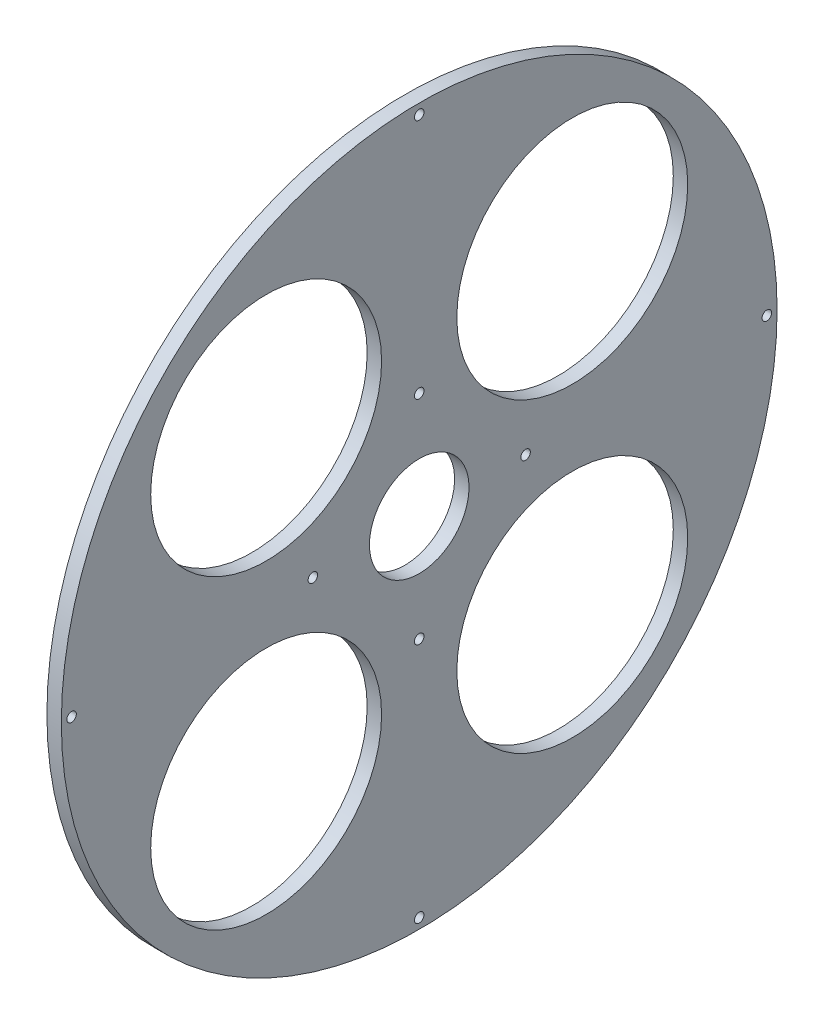
ISO-10303-21;
HEADER;
FILE_DESCRIPTION(('STEP AP214'),'2;1');
FILE_NAME('part.step','',(''),(''),'','','');
FILE_SCHEMA(('AUTOMOTIVE_DESIGN { 1 0 10303 214 1 1 1 1 }'));
ENDSEC;
DATA;
#1=APPLICATION_CONTEXT('core data for automotive mechanical design processes');
#2=APPLICATION_PROTOCOL_DEFINITION('international standard','automotive_design',2000,#1);
#3=PRODUCT_CONTEXT('',#1,'mechanical');
#4=PRODUCT('Part','Part','',(#3));
#5=PRODUCT_RELATED_PRODUCT_CATEGORY('part','',(#4));
#6=PRODUCT_DEFINITION_FORMATION('','',#4);
#7=PRODUCT_DEFINITION_CONTEXT('part definition',#1,'design');
#8=PRODUCT_DEFINITION('design','',#6,#7);
#9=PRODUCT_DEFINITION_SHAPE('','',#8);
#10=(LENGTH_UNIT() NAMED_UNIT(*) SI_UNIT(.MILLI.,.METRE.));
#11=(NAMED_UNIT(*) PLANE_ANGLE_UNIT() SI_UNIT($,.RADIAN.));
#12=(NAMED_UNIT(*) SI_UNIT($,.STERADIAN.) SOLID_ANGLE_UNIT());
#13=UNCERTAINTY_MEASURE_WITH_UNIT(LENGTH_MEASURE(1.E-05),#10,'distance_accuracy_value','');
#14=(GEOMETRIC_REPRESENTATION_CONTEXT(3) GLOBAL_UNCERTAINTY_ASSIGNED_CONTEXT((#13)) GLOBAL_UNIT_ASSIGNED_CONTEXT((#10,
#11,#12)) REPRESENTATION_CONTEXT('',''));
#15=CARTESIAN_POINT('',(0.,0.,0.));
#16=DIRECTION('',(0.,0.,1.));
#17=DIRECTION('',(1.,0.,0.));
#18=AXIS2_PLACEMENT_3D('',#15,#16,#17);
#19=CARTESIAN_POINT('',(-5.00000000000001,248.,0.));
#20=DIRECTION('',(1.,0.,0.));
#21=DIRECTION('',(0.,0.,-1.));
#22=AXIS2_PLACEMENT_3D('',#19,#20,#21);
#23=PLANE('',#22);
#24=CARTESIAN_POINT('',(-5.00000000000001,240.895271507244,0.));
#25=DIRECTION('',(1.,0.,0.));
#26=DIRECTION('',(0.,0.,-1.));
#27=AXIS2_PLACEMENT_3D('',#24,#25,#26);
#28=CIRCLE('',#27,3.3);
#29=CARTESIAN_POINT('',(-5.00000000000001,240.895271507244,-3.3));
#30=VERTEX_POINT('',#29);
#31=EDGE_CURVE('E81',#30,#30,#28,.F.);
#32=ORIENTED_EDGE('',*,*,#31,.F.);
#33=EDGE_LOOP('',(#32));
#34=FACE_BOUND('',#33,.T.);
#35=CARTESIAN_POINT('',(-5.00000000000001,6.81715424761907E-12,-240.895271507251));
#36=DIRECTION('',(1.,0.,0.));
#37=DIRECTION('',(0.,0.,-1.));
#38=AXIS2_PLACEMENT_3D('',#35,#36,#37);
#39=CIRCLE('',#38,3.29999999999999);
#40=CARTESIAN_POINT('',(-5.00000000000001,6.81715424761907E-12,-244.195271507251));
#41=VERTEX_POINT('',#40);
#42=EDGE_CURVE('E71',#41,#41,#39,.F.);
#43=ORIENTED_EDGE('',*,*,#42,.F.);
#44=EDGE_LOOP('',(#43));
#45=FACE_BOUND('',#44,.T.);
#46=CARTESIAN_POINT('',(-5.00000000000001,-240.895271507244,-1.36352882126775E-11));
#47=DIRECTION('',(1.,0.,0.));
#48=DIRECTION('',(0.,0.,-1.));
#49=AXIS2_PLACEMENT_3D('',#46,#47,#48);
#50=CIRCLE('',#49,3.3);
#51=CARTESIAN_POINT('',(-5.00000000000001,-240.895271507244,-3.30000000001363));
#52=VERTEX_POINT('',#51);
#53=EDGE_CURVE('E68',#52,#52,#50,.F.);
#54=ORIENTED_EDGE('',*,*,#53,.F.);
#55=EDGE_LOOP('',(#54));
#56=FACE_BOUND('',#55,.T.);
#57=CARTESIAN_POINT('',(-5.00000000000001,106.06601717798,-106.066017177984));
#58=DIRECTION('',(-1.,0.,0.));
#59=DIRECTION('',(0.,0.,1.));
#60=AXIS2_PLACEMENT_3D('',#57,#58,#59);
#61=CIRCLE('',#60,80.);
#62=CARTESIAN_POINT('',(-5.00000000000001,106.06601717798,-26.0660171779842));
#63=VERTEX_POINT('',#62);
#64=EDGE_CURVE('E89',#63,#63,#61,.T.);
#65=ORIENTED_EDGE('',*,*,#64,.F.);
#66=EDGE_LOOP('',(#65));
#67=FACE_BOUND('',#66,.T.);
#68=CARTESIAN_POINT('',(-5.00000000000001,-106.066017177986,-106.066017177982));
#69=DIRECTION('',(-1.,0.,0.));
#70=DIRECTION('',(0.,0.,1.));
#71=AXIS2_PLACEMENT_3D('',#68,#69,#70);
#72=CIRCLE('',#71,80.);
#73=CARTESIAN_POINT('',(-5.00000000000001,-106.066017177986,-26.0660171779819));
#74=VERTEX_POINT('',#73);
#75=EDGE_CURVE('E93',#74,#74,#72,.T.);
#76=ORIENTED_EDGE('',*,*,#75,.F.);
#77=EDGE_LOOP('',(#76));
#78=FACE_BOUND('',#77,.T.);
#79=CARTESIAN_POINT('',(-5.00000000000001,-106.066017177984,106.066017177984));
#80=DIRECTION('',(-1.,0.,0.));
#81=DIRECTION('',(0.,0.,1.));
#82=AXIS2_PLACEMENT_3D('',#79,#80,#81);
#83=CIRCLE('',#82,80.);
#84=CARTESIAN_POINT('',(-5.00000000000001,-106.066017177984,186.066017177984));
#85=VERTEX_POINT('',#84);
#86=EDGE_CURVE('E99',#85,#85,#83,.T.);
#87=ORIENTED_EDGE('',*,*,#86,.F.);
#88=EDGE_LOOP('',(#87));
#89=FACE_BOUND('',#88,.T.);
#90=CARTESIAN_POINT('',(-5.00000000000001,106.066017177982,106.066017177982));
#91=DIRECTION('',(-1.,0.,0.));
#92=DIRECTION('',(0.,0.,1.));
#93=AXIS2_PLACEMENT_3D('',#90,#91,#92);
#94=CIRCLE('',#93,80.);
#95=CARTESIAN_POINT('',(-5.00000000000001,106.066017177982,186.066017177982));
#96=VERTEX_POINT('',#95);
#97=EDGE_CURVE('E105',#96,#96,#94,.T.);
#98=ORIENTED_EDGE('',*,*,#97,.F.);
#99=EDGE_LOOP('',(#98));
#100=FACE_BOUND('',#99,.T.);
#101=CARTESIAN_POINT('',(-5.00000000000001,73.7,0.));
#102=DIRECTION('',(1.,0.,0.));
#103=DIRECTION('',(0.,0.,-1.));
#104=AXIS2_PLACEMENT_3D('',#101,#102,#103);
#105=CIRCLE('',#104,3.29999999999999);
#106=CARTESIAN_POINT('',(-5.00000000000001,73.7,-3.29999999999999));
#107=VERTEX_POINT('',#106);
#108=EDGE_CURVE('E61',#107,#107,#105,.T.);
#109=ORIENTED_EDGE('',*,*,#108,.T.);
#110=EDGE_LOOP('',(#109));
#111=FACE_BOUND('',#110,.T.);
#112=CARTESIAN_POINT('',(-5.00000000000001,0.,73.7));
#113=DIRECTION('',(1.,0.,0.));
#114=DIRECTION('',(0.,0.,-1.));
#115=AXIS2_PLACEMENT_3D('',#112,#113,#114);
#116=CIRCLE('',#115,3.29999999999999);
#117=CARTESIAN_POINT('',(-5.00000000000001,0.,70.4));
#118=VERTEX_POINT('',#117);
#119=EDGE_CURVE('E57',#118,#118,#116,.T.);
#120=ORIENTED_EDGE('',*,*,#119,.T.);
#121=EDGE_LOOP('',(#120));
#122=FACE_BOUND('',#121,.T.);
#123=CARTESIAN_POINT('',(-5.00000000000001,-73.7000000000001,0.));
#124=DIRECTION('',(1.,0.,0.));
#125=DIRECTION('',(0.,0.,-1.));
#126=AXIS2_PLACEMENT_3D('',#123,#124,#125);
#127=CIRCLE('',#126,3.29999999999999);
#128=CARTESIAN_POINT('',(-5.00000000000001,-73.7000000000001,-3.30000000000003));
#129=VERTEX_POINT('',#128);
#130=EDGE_CURVE('E53',#129,#129,#127,.T.);
#131=ORIENTED_EDGE('',*,*,#130,.T.);
#132=EDGE_LOOP('',(#131));
#133=FACE_BOUND('',#132,.T.);
#134=CARTESIAN_POINT('',(-5.00000000000001,0.,-73.7000000000001));
#135=DIRECTION('',(1.,0.,0.));
#136=DIRECTION('',(0.,0.,-1.));
#137=AXIS2_PLACEMENT_3D('',#134,#135,#136);
#138=CIRCLE('',#137,3.29999999999999);
#139=CARTESIAN_POINT('',(-5.00000000000001,0.,-77.0000000000001));
#140=VERTEX_POINT('',#139);
#141=EDGE_CURVE('E48',#140,#140,#138,.T.);
#142=ORIENTED_EDGE('',*,*,#141,.T.);
#143=EDGE_LOOP('',(#142));
#144=FACE_BOUND('',#143,.T.);
#145=CARTESIAN_POINT('',(-5.00000000000002,0.,0.));
#146=DIRECTION('',(-1.,0.,0.));
#147=DIRECTION('',(0.,0.,1.));
#148=AXIS2_PLACEMENT_3D('',#145,#146,#147);
#149=CIRCLE('',#148,34.5);
#150=CARTESIAN_POINT('',(-5.00000000000002,0.,34.5));
#151=VERTEX_POINT('',#150);
#152=EDGE_CURVE('E39',#151,#151,#149,.T.);
#153=ORIENTED_EDGE('',*,*,#152,.F.);
#154=EDGE_LOOP('',(#153));
#155=FACE_BOUND('',#154,.T.);
#156=CARTESIAN_POINT('',(-5.,0.,0.));
#157=DIRECTION('',(-1.,0.,0.));
#158=DIRECTION('',(0.,0.,1.));
#159=AXIS2_PLACEMENT_3D('',#156,#157,#158);
#160=CIRCLE('',#159,248.);
#161=CARTESIAN_POINT('',(-5.,0.,248.));
#162=VERTEX_POINT('',#161);
#163=EDGE_CURVE('E44',#162,#162,#160,.T.);
#164=ORIENTED_EDGE('',*,*,#163,.T.);
#165=EDGE_LOOP('',(#164));
#166=FACE_BOUND('',#165,.T.);
#167=CARTESIAN_POINT('',(-5.00000000000001,-6.78765308530096E-12,240.895271507238));
#168=DIRECTION('',(1.,0.,0.));
#169=DIRECTION('',(0.,0.,-1.));
#170=AXIS2_PLACEMENT_3D('',#167,#168,#169);
#171=CIRCLE('',#170,3.29999999999999);
#172=CARTESIAN_POINT('',(-5.00000000000001,-6.78765308530096E-12,237.595271507238));
#173=VERTEX_POINT('',#172);
#174=EDGE_CURVE('E67',#173,#173,#171,.F.);
#175=ORIENTED_EDGE('',*,*,#174,.F.);
#176=EDGE_LOOP('',(#175));
#177=FACE_BOUND('',#176,.T.);
#178=ADVANCED_FACE('F31',(#34,#45,#56,#67,#78,#89,#100,#111,#122,#133,#144,#155,#166,#177),#23,.F.);
#179=CARTESIAN_POINT('',(5.00000000000001,248.,0.));
#180=DIRECTION('',(-1.,0.,0.));
#181=DIRECTION('',(0.,0.,1.));
#182=AXIS2_PLACEMENT_3D('',#179,#180,#181);
#183=PLANE('',#182);
#184=CARTESIAN_POINT('',(5.00000000000001,240.895271507244,0.));
#185=DIRECTION('',(-1.,0.,0.));
#186=DIRECTION('',(0.,0.,1.));
#187=AXIS2_PLACEMENT_3D('',#184,#185,#186);
#188=CIRCLE('',#187,3.3);
#189=CARTESIAN_POINT('',(5.00000000000001,240.895271507244,3.3));
#190=VERTEX_POINT('',#189);
#191=EDGE_CURVE('E35',#190,#190,#188,.T.);
#192=ORIENTED_EDGE('',*,*,#191,.T.);
#193=EDGE_LOOP('',(#192));
#194=FACE_BOUND('',#193,.T.);
#195=CARTESIAN_POINT('',(5.00000000000001,6.81715424761907E-12,-240.895271507251));
#196=DIRECTION('',(-1.,0.,0.));
#197=DIRECTION('',(0.,0.,1.));
#198=AXIS2_PLACEMENT_3D('',#195,#196,#197);
#199=CIRCLE('',#198,3.29999999999999);
#200=CARTESIAN_POINT('',(5.00000000000001,6.81715424761907E-12,-237.595271507251));
#201=VERTEX_POINT('',#200);
#202=EDGE_CURVE('E69',#201,#201,#199,.T.);
#203=ORIENTED_EDGE('',*,*,#202,.T.);
#204=EDGE_LOOP('',(#203));
#205=FACE_BOUND('',#204,.T.);
#206=CARTESIAN_POINT('',(5.00000000000001,-240.895271507244,-1.36352882126775E-11));
#207=DIRECTION('',(-1.,0.,0.));
#208=DIRECTION('',(0.,0.,1.));
#209=AXIS2_PLACEMENT_3D('',#206,#207,#208);
#210=CIRCLE('',#209,3.3);
#211=CARTESIAN_POINT('',(5.00000000000001,-240.895271507244,3.29999999998636));
#212=VERTEX_POINT('',#211);
#213=EDGE_CURVE('E65',#212,#212,#210,.T.);
#214=ORIENTED_EDGE('',*,*,#213,.T.);
#215=EDGE_LOOP('',(#214));
#216=FACE_BOUND('',#215,.T.);
#217=CARTESIAN_POINT('',(5.00000000000001,-6.78765308530096E-12,240.895271507238));
#218=DIRECTION('',(-1.,0.,0.));
#219=DIRECTION('',(0.,0.,1.));
#220=AXIS2_PLACEMENT_3D('',#217,#218,#219);
#221=CIRCLE('',#220,3.29999999999999);
#222=CARTESIAN_POINT('',(5.00000000000001,-6.78765308530096E-12,244.195271507238));
#223=VERTEX_POINT('',#222);
#224=EDGE_CURVE('E86',#223,#223,#221,.T.);
#225=ORIENTED_EDGE('',*,*,#224,.T.);
#226=EDGE_LOOP('',(#225));
#227=FACE_BOUND('',#226,.T.);
#228=CARTESIAN_POINT('',(5.00000000000002,106.06601717798,-106.066017177984));
#229=DIRECTION('',(-1.,0.,0.));
#230=DIRECTION('',(0.,0.,1.));
#231=AXIS2_PLACEMENT_3D('',#228,#229,#230);
#232=CIRCLE('',#231,80.);
#233=CARTESIAN_POINT('',(5.00000000000002,106.06601717798,-26.0660171779842));
#234=VERTEX_POINT('',#233);
#235=EDGE_CURVE('E90',#234,#234,#232,.T.);
#236=ORIENTED_EDGE('',*,*,#235,.T.);
#237=EDGE_LOOP('',(#236));
#238=FACE_BOUND('',#237,.T.);
#239=CARTESIAN_POINT('',(5.00000000000002,-106.066017177986,-106.066017177982));
#240=DIRECTION('',(-1.,0.,0.));
#241=DIRECTION('',(0.,0.,1.));
#242=AXIS2_PLACEMENT_3D('',#239,#240,#241);
#243=CIRCLE('',#242,80.);
#244=CARTESIAN_POINT('',(5.00000000000002,-106.066017177986,-26.0660171779819));
#245=VERTEX_POINT('',#244);
#246=EDGE_CURVE('E96',#245,#245,#243,.T.);
#247=ORIENTED_EDGE('',*,*,#246,.T.);
#248=EDGE_LOOP('',(#247));
#249=FACE_BOUND('',#248,.T.);
#250=CARTESIAN_POINT('',(5.00000000000002,-106.066017177984,106.066017177984));
#251=DIRECTION('',(-1.,0.,0.));
#252=DIRECTION('',(0.,0.,1.));
#253=AXIS2_PLACEMENT_3D('',#250,#251,#252);
#254=CIRCLE('',#253,80.);
#255=CARTESIAN_POINT('',(5.00000000000002,-106.066017177984,186.066017177984));
#256=VERTEX_POINT('',#255);
#257=EDGE_CURVE('E102',#256,#256,#254,.T.);
#258=ORIENTED_EDGE('',*,*,#257,.T.);
#259=EDGE_LOOP('',(#258));
#260=FACE_BOUND('',#259,.T.);
#261=CARTESIAN_POINT('',(5.00000000000002,106.066017177982,106.066017177982));
#262=DIRECTION('',(-1.,0.,0.));
#263=DIRECTION('',(0.,0.,1.));
#264=AXIS2_PLACEMENT_3D('',#261,#262,#263);
#265=CIRCLE('',#264,80.);
#266=CARTESIAN_POINT('',(5.00000000000002,106.066017177982,186.066017177982));
#267=VERTEX_POINT('',#266);
#268=EDGE_CURVE('E108',#267,#267,#265,.T.);
#269=ORIENTED_EDGE('',*,*,#268,.T.);
#270=EDGE_LOOP('',(#269));
#271=FACE_BOUND('',#270,.T.);
#272=CARTESIAN_POINT('',(5.00000000000002,-73.7000000000001,0.));
#273=DIRECTION('',(-1.,0.,0.));
#274=DIRECTION('',(0.,0.,1.));
#275=AXIS2_PLACEMENT_3D('',#272,#273,#274);
#276=CIRCLE('',#275,3.29999999999999);
#277=CARTESIAN_POINT('',(5.00000000000002,-73.7000000000001,3.29999999999996));
#278=VERTEX_POINT('',#277);
#279=EDGE_CURVE('E56',#278,#278,#276,.F.);
#280=ORIENTED_EDGE('',*,*,#279,.F.);
#281=EDGE_LOOP('',(#280));
#282=FACE_BOUND('',#281,.T.);
#283=CARTESIAN_POINT('',(5.,0.,0.));
#284=DIRECTION('',(-1.,0.,0.));
#285=DIRECTION('',(0.,0.,1.));
#286=AXIS2_PLACEMENT_3D('',#283,#284,#285);
#287=CIRCLE('',#286,248.);
#288=CARTESIAN_POINT('',(5.,0.,248.));
#289=VERTEX_POINT('',#288);
#290=EDGE_CURVE('E51',#289,#289,#287,.T.);
#291=ORIENTED_EDGE('',*,*,#290,.F.);
#292=EDGE_LOOP('',(#291));
#293=FACE_BOUND('',#292,.T.);
#294=CARTESIAN_POINT('',(5.00000000000002,0.,0.));
#295=DIRECTION('',(-1.,0.,0.));
#296=DIRECTION('',(0.,0.,1.));
#297=AXIS2_PLACEMENT_3D('',#294,#295,#296);
#298=CIRCLE('',#297,34.5);
#299=CARTESIAN_POINT('',(5.00000000000002,0.,34.5));
#300=VERTEX_POINT('',#299);
#301=EDGE_CURVE('E10',#300,#300,#298,.T.);
#302=ORIENTED_EDGE('',*,*,#301,.T.);
#303=EDGE_LOOP('',(#302));
#304=FACE_BOUND('',#303,.T.);
#305=CARTESIAN_POINT('',(5.00000000000002,0.,-73.7000000000001));
#306=DIRECTION('',(-1.,0.,0.));
#307=DIRECTION('',(0.,0.,1.));
#308=AXIS2_PLACEMENT_3D('',#305,#306,#307);
#309=CIRCLE('',#308,3.29999999999999);
#310=CARTESIAN_POINT('',(5.00000000000002,0.,-70.4000000000001));
#311=VERTEX_POINT('',#310);
#312=EDGE_CURVE('E52',#311,#311,#309,.F.);
#313=ORIENTED_EDGE('',*,*,#312,.F.);
#314=EDGE_LOOP('',(#313));
#315=FACE_BOUND('',#314,.T.);
#316=CARTESIAN_POINT('',(5.00000000000002,0.,73.7));
#317=DIRECTION('',(-1.,0.,0.));
#318=DIRECTION('',(0.,0.,1.));
#319=AXIS2_PLACEMENT_3D('',#316,#317,#318);
#320=CIRCLE('',#319,3.29999999999999);
#321=CARTESIAN_POINT('',(5.00000000000002,0.,77.));
#322=VERTEX_POINT('',#321);
#323=EDGE_CURVE('E60',#322,#322,#320,.F.);
#324=ORIENTED_EDGE('',*,*,#323,.F.);
#325=EDGE_LOOP('',(#324));
#326=FACE_BOUND('',#325,.T.);
#327=CARTESIAN_POINT('',(5.00000000000002,73.7,0.));
#328=DIRECTION('',(-1.,0.,0.));
#329=DIRECTION('',(0.,0.,1.));
#330=AXIS2_PLACEMENT_3D('',#327,#328,#329);
#331=CIRCLE('',#330,3.29999999999999);
#332=CARTESIAN_POINT('',(5.00000000000002,73.7,3.29999999999999));
#333=VERTEX_POINT('',#332);
#334=EDGE_CURVE('E64',#333,#333,#331,.F.);
#335=ORIENTED_EDGE('',*,*,#334,.F.);
#336=EDGE_LOOP('',(#335));
#337=FACE_BOUND('',#336,.T.);
#338=ADVANCED_FACE('F33',(#194,#205,#216,#227,#238,#249,#260,#271,#282,#293,#304,#315,#326,
#337),#183,.F.);
#339=CARTESIAN_POINT('',(0.,0.,0.));
#340=DIRECTION('',(-1.,0.,0.));
#341=DIRECTION('',(0.,0.,1.));
#342=AXIS2_PLACEMENT_3D('',#339,#340,#341);
#343=CYLINDRICAL_SURFACE('',#342,34.5);
#344=ORIENTED_EDGE('',*,*,#301,.F.);
#345=EDGE_LOOP('',(#344));
#346=FACE_BOUND('',#345,.T.);
#347=ORIENTED_EDGE('',*,*,#152,.T.);
#348=EDGE_LOOP('',(#347));
#349=FACE_BOUND('',#348,.T.);
#350=ADVANCED_FACE('F131',(#346,#349),#343,.F.);
#351=CARTESIAN_POINT('',(0.,0.,0.));
#352=DIRECTION('',(-1.,0.,0.));
#353=DIRECTION('',(0.,0.,1.));
#354=AXIS2_PLACEMENT_3D('',#351,#352,#353);
#355=CYLINDRICAL_SURFACE('',#354,248.);
#356=ORIENTED_EDGE('',*,*,#163,.F.);
#357=EDGE_LOOP('',(#356));
#358=FACE_BOUND('',#357,.T.);
#359=ORIENTED_EDGE('',*,*,#290,.T.);
#360=EDGE_LOOP('',(#359));
#361=FACE_BOUND('',#360,.T.);
#362=ADVANCED_FACE('F127',(#358,#361),#355,.T.);
#363=CARTESIAN_POINT('',(-18.8000000000001,0.,-73.7000000000001));
#364=DIRECTION('',(-1.,0.,0.));
#365=DIRECTION('',(0.,0.,1.));
#366=AXIS2_PLACEMENT_3D('',#363,#364,#365);
#367=CYLINDRICAL_SURFACE('',#366,3.29999999999999);
#368=ORIENTED_EDGE('',*,*,#312,.T.);
#369=EDGE_LOOP('',(#368));
#370=FACE_BOUND('',#369,.T.);
#371=ORIENTED_EDGE('',*,*,#141,.F.);
#372=EDGE_LOOP('',(#371));
#373=FACE_BOUND('',#372,.T.);
#374=ADVANCED_FACE('F130',(#370,#373),#367,.F.);
#375=CARTESIAN_POINT('',(-18.7999999999999,-73.7000000000001,0.));
#376=DIRECTION('',(-1.,0.,0.));
#377=DIRECTION('',(0.,0.,1.));
#378=AXIS2_PLACEMENT_3D('',#375,#376,#377);
#379=CYLINDRICAL_SURFACE('',#378,3.29999999999999);
#380=ORIENTED_EDGE('',*,*,#279,.T.);
#381=EDGE_LOOP('',(#380));
#382=FACE_BOUND('',#381,.T.);
#383=ORIENTED_EDGE('',*,*,#130,.F.);
#384=EDGE_LOOP('',(#383));
#385=FACE_BOUND('',#384,.T.);
#386=ADVANCED_FACE('F171',(#382,#385),#379,.F.);
#387=CARTESIAN_POINT('',(-18.8000000000001,0.,73.7));
#388=DIRECTION('',(-1.,0.,0.));
#389=DIRECTION('',(0.,0.,1.));
#390=AXIS2_PLACEMENT_3D('',#387,#388,#389);
#391=CYLINDRICAL_SURFACE('',#390,3.29999999999999);
#392=ORIENTED_EDGE('',*,*,#323,.T.);
#393=EDGE_LOOP('',(#392));
#394=FACE_BOUND('',#393,.T.);
#395=ORIENTED_EDGE('',*,*,#119,.F.);
#396=EDGE_LOOP('',(#395));
#397=FACE_BOUND('',#396,.T.);
#398=ADVANCED_FACE('F148',(#394,#397),#391,.F.);
#399=CARTESIAN_POINT('',(-18.8000000000004,73.7,0.));
#400=DIRECTION('',(-1.,0.,0.));
#401=DIRECTION('',(0.,0.,1.));
#402=AXIS2_PLACEMENT_3D('',#399,#400,#401);
#403=CYLINDRICAL_SURFACE('',#402,3.29999999999999);
#404=ORIENTED_EDGE('',*,*,#334,.T.);
#405=EDGE_LOOP('',(#404));
#406=FACE_BOUND('',#405,.T.);
#407=ORIENTED_EDGE('',*,*,#108,.F.);
#408=EDGE_LOOP('',(#407));
#409=FACE_BOUND('',#408,.T.);
#410=ADVANCED_FACE('F144',(#406,#409),#403,.F.);
#411=CARTESIAN_POINT('',(5.00000000000002,106.066017177982,106.066017177982));
#412=DIRECTION('',(-1.,0.,0.));
#413=DIRECTION('',(0.,0.,1.));
#414=AXIS2_PLACEMENT_3D('',#411,#412,#413);
#415=CYLINDRICAL_SURFACE('',#414,80.);
#416=ORIENTED_EDGE('',*,*,#268,.F.);
#417=EDGE_LOOP('',(#416));
#418=FACE_BOUND('',#417,.T.);
#419=ORIENTED_EDGE('',*,*,#97,.T.);
#420=EDGE_LOOP('',(#419));
#421=FACE_BOUND('',#420,.T.);
#422=ADVANCED_FACE('F147',(#418,#421),#415,.F.);
#423=CARTESIAN_POINT('',(5.00000000000002,-106.066017177984,106.066017177984));
#424=DIRECTION('',(-1.,0.,0.));
#425=DIRECTION('',(0.,0.,1.));
#426=AXIS2_PLACEMENT_3D('',#423,#424,#425);
#427=CYLINDRICAL_SURFACE('',#426,80.);
#428=ORIENTED_EDGE('',*,*,#257,.F.);
#429=EDGE_LOOP('',(#428));
#430=FACE_BOUND('',#429,.T.);
#431=ORIENTED_EDGE('',*,*,#86,.T.);
#432=EDGE_LOOP('',(#431));
#433=FACE_BOUND('',#432,.T.);
#434=ADVANCED_FACE('F181',(#430,#433),#427,.F.);
#435=CARTESIAN_POINT('',(5.00000000000002,-106.066017177986,-106.066017177982));
#436=DIRECTION('',(-1.,0.,0.));
#437=DIRECTION('',(0.,0.,1.));
#438=AXIS2_PLACEMENT_3D('',#435,#436,#437);
#439=CYLINDRICAL_SURFACE('',#438,80.);
#440=ORIENTED_EDGE('',*,*,#246,.F.);
#441=EDGE_LOOP('',(#440));
#442=FACE_BOUND('',#441,.T.);
#443=ORIENTED_EDGE('',*,*,#75,.T.);
#444=EDGE_LOOP('',(#443));
#445=FACE_BOUND('',#444,.T.);
#446=ADVANCED_FACE('F185',(#442,#445),#439,.F.);
#447=CARTESIAN_POINT('',(5.00000000000002,106.06601717798,-106.066017177984));
#448=DIRECTION('',(-1.,0.,0.));
#449=DIRECTION('',(0.,0.,1.));
#450=AXIS2_PLACEMENT_3D('',#447,#448,#449);
#451=CYLINDRICAL_SURFACE('',#450,80.);
#452=ORIENTED_EDGE('',*,*,#235,.F.);
#453=EDGE_LOOP('',(#452));
#454=FACE_BOUND('',#453,.T.);
#455=ORIENTED_EDGE('',*,*,#64,.T.);
#456=EDGE_LOOP('',(#455));
#457=FACE_BOUND('',#456,.T.);
#458=ADVANCED_FACE('F189',(#454,#457),#451,.F.);
#459=CARTESIAN_POINT('',(14.3436216216216,-6.78765308530096E-12,240.895271507238));
#460=DIRECTION('',(1.,0.,0.));
#461=DIRECTION('',(0.,0.,-1.));
#462=AXIS2_PLACEMENT_3D('',#459,#460,#461);
#463=CYLINDRICAL_SURFACE('',#462,3.29999999999999);
#464=ORIENTED_EDGE('',*,*,#174,.T.);
#465=EDGE_LOOP('',(#464));
#466=FACE_BOUND('',#465,.T.);
#467=ORIENTED_EDGE('',*,*,#224,.F.);
#468=EDGE_LOOP('',(#467));
#469=FACE_BOUND('',#468,.T.);
#470=ADVANCED_FACE('F193',(#466,#469),#463,.F.);
#471=CARTESIAN_POINT('',(14.3436216216216,-240.895271507244,-1.36352882126775E-11));
#472=DIRECTION('',(1.,0.,0.));
#473=DIRECTION('',(0.,0.,-1.));
#474=AXIS2_PLACEMENT_3D('',#471,#472,#473);
#475=CYLINDRICAL_SURFACE('',#474,3.3);
#476=ORIENTED_EDGE('',*,*,#53,.T.);
#477=EDGE_LOOP('',(#476));
#478=FACE_BOUND('',#477,.T.);
#479=ORIENTED_EDGE('',*,*,#213,.F.);
#480=EDGE_LOOP('',(#479));
#481=FACE_BOUND('',#480,.T.);
#482=ADVANCED_FACE('F197',(#478,#481),#475,.F.);
#483=CARTESIAN_POINT('',(14.3436216216216,6.81715424761907E-12,-240.895271507251));
#484=DIRECTION('',(1.,0.,0.));
#485=DIRECTION('',(0.,0.,-1.));
#486=AXIS2_PLACEMENT_3D('',#483,#484,#485);
#487=CYLINDRICAL_SURFACE('',#486,3.29999999999999);
#488=ORIENTED_EDGE('',*,*,#42,.T.);
#489=EDGE_LOOP('',(#488));
#490=FACE_BOUND('',#489,.T.);
#491=ORIENTED_EDGE('',*,*,#202,.F.);
#492=EDGE_LOOP('',(#491));
#493=FACE_BOUND('',#492,.T.);
#494=ADVANCED_FACE('F201',(#490,#493),#487,.F.);
#495=CARTESIAN_POINT('',(14.3436216216216,240.895271507244,0.));
#496=DIRECTION('',(1.,0.,0.));
#497=DIRECTION('',(0.,0.,-1.));
#498=AXIS2_PLACEMENT_3D('',#495,#496,#497);
#499=CYLINDRICAL_SURFACE('',#498,3.3);
#500=ORIENTED_EDGE('',*,*,#31,.T.);
#501=EDGE_LOOP('',(#500));
#502=FACE_BOUND('',#501,.T.);
#503=ORIENTED_EDGE('',*,*,#191,.F.);
#504=EDGE_LOOP('',(#503));
#505=FACE_BOUND('',#504,.T.);
#506=ADVANCED_FACE('F205',(#502,#505),#499,.F.);
#507=CLOSED_SHELL('',(#178,#338,#350,#362,#374,#386,#398,#410,#422,#434,#446,#458,#470,#482,
#494,#506));
#508=MANIFOLD_SOLID_BREP('B2',#507);
#509=ADVANCED_BREP_SHAPE_REPRESENTATION('',(#18,#508),#14);
#510=SHAPE_DEFINITION_REPRESENTATION(#9,#509);
ENDSEC;
END-ISO-10303-21;
